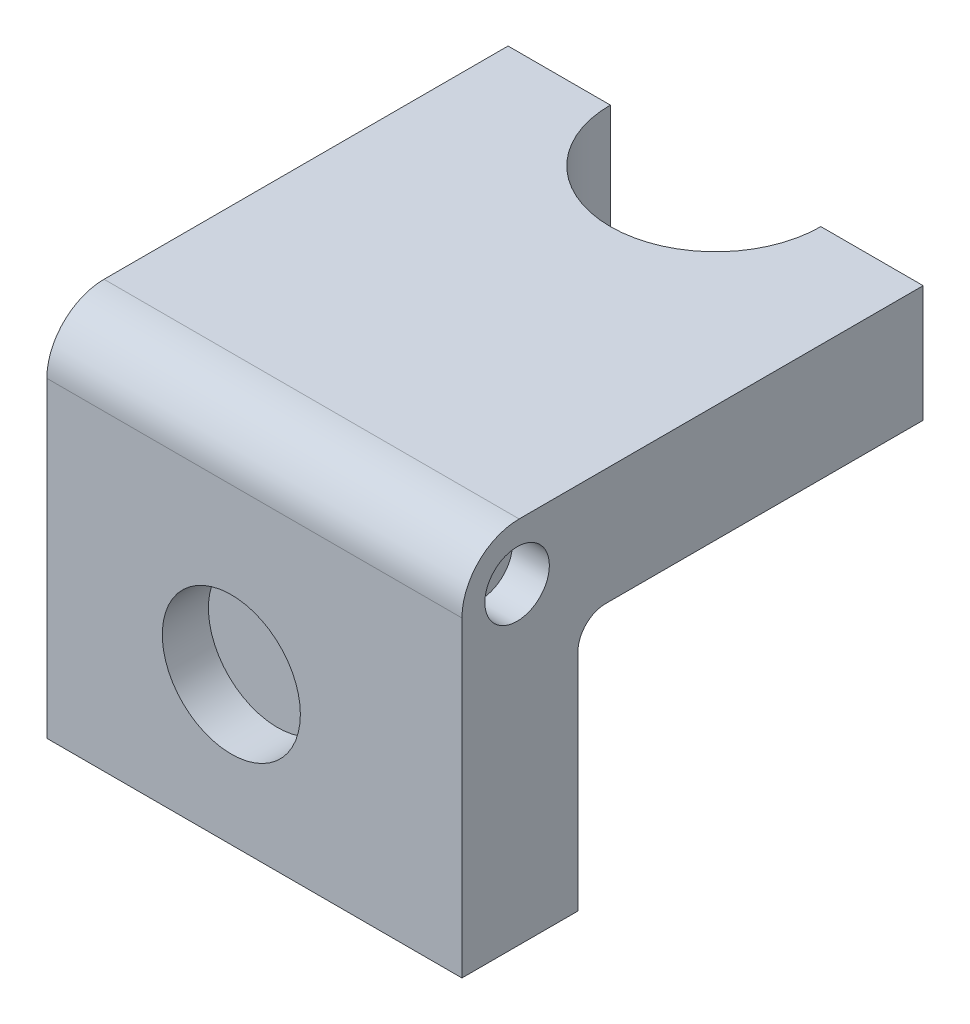
ISO-10303-21;
HEADER;
FILE_DESCRIPTION(('STEP AP214'),'2;1');
FILE_NAME('part.step','',(''),(''),'','','');
FILE_SCHEMA(('AUTOMOTIVE_DESIGN { 1 0 10303 214 1 1 1 1 }'));
ENDSEC;
DATA;
#1=APPLICATION_CONTEXT('core data for automotive mechanical design processes');
#2=APPLICATION_PROTOCOL_DEFINITION('international standard','automotive_design',2000,#1);
#3=PRODUCT_CONTEXT('',#1,'mechanical');
#4=PRODUCT('Part','Part','',(#3));
#5=PRODUCT_RELATED_PRODUCT_CATEGORY('part','',(#4));
#6=PRODUCT_DEFINITION_FORMATION('','',#4);
#7=PRODUCT_DEFINITION_CONTEXT('part definition',#1,'design');
#8=PRODUCT_DEFINITION('design','',#6,#7);
#9=PRODUCT_DEFINITION_SHAPE('','',#8);
#10=(LENGTH_UNIT() NAMED_UNIT(*) SI_UNIT(.MILLI.,.METRE.));
#11=(NAMED_UNIT(*) PLANE_ANGLE_UNIT() SI_UNIT($,.RADIAN.));
#12=(NAMED_UNIT(*) SI_UNIT($,.STERADIAN.) SOLID_ANGLE_UNIT());
#13=UNCERTAINTY_MEASURE_WITH_UNIT(LENGTH_MEASURE(1.E-05),#10,'distance_accuracy_value','');
#14=(GEOMETRIC_REPRESENTATION_CONTEXT(3) GLOBAL_UNCERTAINTY_ASSIGNED_CONTEXT((#13)) GLOBAL_UNIT_ASSIGNED_CONTEXT((#10,
#11,#12)) REPRESENTATION_CONTEXT('',''));
#15=CARTESIAN_POINT('',(0.,0.,0.));
#16=DIRECTION('',(0.,0.,1.));
#17=DIRECTION('',(1.,0.,0.));
#18=AXIS2_PLACEMENT_3D('',#15,#16,#17);
#19=CARTESIAN_POINT('',(0.,0.,0.));
#20=DIRECTION('',(0.,0.,-1.));
#21=DIRECTION('',(-1.,0.,0.));
#22=AXIS2_PLACEMENT_3D('',#19,#20,#21);
#23=PLANE('',#22);
#24=DIRECTION('',(-1.,0.,0.));
#25=VECTOR('',#24,1.);
#26=CARTESIAN_POINT('',(0.,50.8,0.));
#27=LINE('',#26,#25);
#28=CARTESIAN_POINT('',(14.0819477642499,50.8,0.));
#29=VERTEX_POINT('',#28);
#30=CARTESIAN_POINT('',(0.,50.8,0.));
#31=VERTEX_POINT('',#30);
#32=EDGE_CURVE('E152',#29,#31,#27,.T.);
#33=ORIENTED_EDGE('',*,*,#32,.F.);
#34=DIRECTION('',(0.,1.,0.));
#35=VECTOR('',#34,1.);
#36=CARTESIAN_POINT('',(14.0819477642499,25.4,0.));
#37=LINE('',#36,#35);
#38=CARTESIAN_POINT('',(14.0819477642499,34.7459144640634,0.));
#39=VERTEX_POINT('',#38);
#40=EDGE_CURVE('E130',#39,#29,#37,.T.);
#41=ORIENTED_EDGE('',*,*,#40,.F.);
#42=DIRECTION('',(1.,0.,0.));
#43=VECTOR('',#42,1.);
#44=CARTESIAN_POINT('',(0.,34.7459144640634,0.));
#45=LINE('',#44,#43);
#46=CARTESIAN_POINT('',(0.,34.7459144640634,0.));
#47=VERTEX_POINT('',#46);
#48=EDGE_CURVE('E236',#47,#39,#45,.T.);
#49=ORIENTED_EDGE('',*,*,#48,.F.);
#50=DIRECTION('',(0.,-1.,0.));
#51=VECTOR('',#50,1.);
#52=CARTESIAN_POINT('',(0.,0.,0.));
#53=LINE('',#52,#51);
#54=EDGE_CURVE('E244',#31,#47,#53,.T.);
#55=ORIENTED_EDGE('',*,*,#54,.F.);
#56=EDGE_LOOP('',(#33,#41,#49,#55));
#57=FACE_BOUND('',#56,.T.);
#58=ADVANCED_FACE('F51',(#57),#23,.T.);
#59=CARTESIAN_POINT('',(43.0680522357501,34.7459144640634,0.));
#60=VERTEX_POINT('',#59);
#61=CARTESIAN_POINT('',(57.15,34.7459144640634,0.));
#62=VERTEX_POINT('',#61);
#63=EDGE_CURVE('E142',#60,#62,#45,.T.);
#64=ORIENTED_EDGE('',*,*,#63,.F.);
#65=DIRECTION('',(0.,1.,0.));
#66=VECTOR('',#65,1.);
#67=CARTESIAN_POINT('',(43.0680522357501,25.4,0.));
#68=LINE('',#67,#66);
#69=CARTESIAN_POINT('',(43.0680522357501,50.8,0.));
#70=VERTEX_POINT('',#69);
#71=EDGE_CURVE('E66',#60,#70,#68,.T.);
#72=ORIENTED_EDGE('',*,*,#71,.T.);
#73=CARTESIAN_POINT('',(57.15,50.8,0.));
#74=VERTEX_POINT('',#73);
#75=EDGE_CURVE('E141',#74,#70,#27,.T.);
#76=ORIENTED_EDGE('',*,*,#75,.F.);
#77=DIRECTION('',(0.,1.,0.));
#78=VECTOR('',#77,1.);
#79=CARTESIAN_POINT('',(57.15,0.,0.));
#80=LINE('',#79,#78);
#81=EDGE_CURVE('E158',#62,#74,#80,.T.);
#82=ORIENTED_EDGE('',*,*,#81,.F.);
#83=EDGE_LOOP('',(#64,#72,#76,#82));
#84=FACE_BOUND('',#83,.T.);
#85=ADVANCED_FACE('F139',(#84),#23,.T.);
#86=CARTESIAN_POINT('',(0.,0.,63.5));
#87=DIRECTION('',(1.,0.,0.));
#88=DIRECTION('',(0.,0.,-1.));
#89=AXIS2_PLACEMENT_3D('',#86,#87,#88);
#90=PLANE('',#89);
#91=DIRECTION('',(0.,0.,1.));
#92=VECTOR('',#91,1.);
#93=CARTESIAN_POINT('',(0.,34.7459144640634,0.));
#94=LINE('',#93,#92);
#95=CARTESIAN_POINT('',(0.,34.7459144640634,43.7146070722916));
#96=VERTEX_POINT('',#95);
#97=EDGE_CURVE('E207',#47,#96,#94,.T.);
#98=ORIENTED_EDGE('',*,*,#97,.T.);
#99=CARTESIAN_POINT('',(0.,30.9359144640634,43.7146070722916));
#100=DIRECTION('',(1.,0.,0.));
#101=DIRECTION('',(0.,0.,-1.));
#102=AXIS2_PLACEMENT_3D('',#99,#100,#101);
#103=CIRCLE('',#102,3.81);
#104=CARTESIAN_POINT('',(0.,30.9359144640634,47.5246070722916));
#105=VERTEX_POINT('',#104);
#106=EDGE_CURVE('E60',#96,#105,#103,.T.);
#107=ORIENTED_EDGE('',*,*,#106,.T.);
#108=DIRECTION('',(0.,-1.,0.));
#109=VECTOR('',#108,1.);
#110=CARTESIAN_POINT('',(0.,0.,47.5246070722916));
#111=LINE('',#110,#109);
#112=CARTESIAN_POINT('',(0.,0.,47.5246070722916));
#113=VERTEX_POINT('',#112);
#114=EDGE_CURVE('E204',#105,#113,#111,.T.);
#115=ORIENTED_EDGE('',*,*,#114,.T.);
#116=DIRECTION('',(0.,0.,-1.));
#117=VECTOR('',#116,1.);
#118=CARTESIAN_POINT('',(0.,0.,63.5));
#119=LINE('',#118,#117);
#120=CARTESIAN_POINT('',(0.,0.,63.5));
#121=VERTEX_POINT('',#120);
#122=EDGE_CURVE('E173',#121,#113,#119,.T.);
#123=ORIENTED_EDGE('',*,*,#122,.F.);
#124=DIRECTION('',(0.,-1.,0.));
#125=VECTOR('',#124,1.);
#126=CARTESIAN_POINT('',(0.,0.,63.5));
#127=LINE('',#126,#125);
#128=CARTESIAN_POINT('',(0.,42.926,63.5));
#129=VERTEX_POINT('',#128);
#130=EDGE_CURVE('E151',#129,#121,#127,.T.);
#131=ORIENTED_EDGE('',*,*,#130,.F.);
#132=CARTESIAN_POINT('',(0.,42.926,55.626));
#133=DIRECTION('',(1.,0.,0.));
#134=DIRECTION('',(0.,0.,-1.));
#135=AXIS2_PLACEMENT_3D('',#132,#133,#134);
#136=CIRCLE('',#135,7.874);
#137=CARTESIAN_POINT('',(0.,50.8,55.626));
#138=VERTEX_POINT('',#137);
#139=EDGE_CURVE('E181',#129,#138,#136,.F.);
#140=ORIENTED_EDGE('',*,*,#139,.T.);
#141=DIRECTION('',(0.,0.,-1.));
#142=VECTOR('',#141,1.);
#143=CARTESIAN_POINT('',(0.,50.8,63.5));
#144=LINE('',#143,#142);
#145=EDGE_CURVE('E162',#138,#31,#144,.T.);
#146=ORIENTED_EDGE('',*,*,#145,.T.);
#147=ORIENTED_EDGE('',*,*,#54,.T.);
#148=EDGE_LOOP('',(#98,#107,#115,#123,#131,#140,#146,#147));
#149=FACE_BOUND('',#148,.T.);
#150=ADVANCED_FACE('F202',(#149),#90,.F.);
#151=CARTESIAN_POINT('',(0.,0.,63.5));
#152=DIRECTION('',(0.,1.,0.));
#153=DIRECTION('',(0.,0.,1.));
#154=AXIS2_PLACEMENT_3D('',#151,#152,#153);
#155=PLANE('',#154);
#156=ORIENTED_EDGE('',*,*,#122,.T.);
#157=DIRECTION('',(1.,0.,0.));
#158=VECTOR('',#157,1.);
#159=CARTESIAN_POINT('',(0.,0.,47.5246070722916));
#160=LINE('',#159,#158);
#161=CARTESIAN_POINT('',(57.15,0.,47.5246070722916));
#162=VERTEX_POINT('',#161);
#163=EDGE_CURVE('E214',#113,#162,#160,.T.);
#164=ORIENTED_EDGE('',*,*,#163,.T.);
#165=DIRECTION('',(0.,0.,-1.));
#166=VECTOR('',#165,1.);
#167=CARTESIAN_POINT('',(57.15,0.,63.5));
#168=LINE('',#167,#166);
#169=CARTESIAN_POINT('',(57.15,0.,63.5));
#170=VERTEX_POINT('',#169);
#171=EDGE_CURVE('E169',#170,#162,#168,.T.);
#172=ORIENTED_EDGE('',*,*,#171,.F.);
#173=DIRECTION('',(1.,0.,0.));
#174=VECTOR('',#173,1.);
#175=CARTESIAN_POINT('',(0.,0.,63.5));
#176=LINE('',#175,#174);
#177=EDGE_CURVE('E156',#121,#170,#176,.T.);
#178=ORIENTED_EDGE('',*,*,#177,.F.);
#179=EDGE_LOOP('',(#156,#164,#172,#178));
#180=FACE_BOUND('',#179,.T.);
#181=ADVANCED_FACE('F267',(#180),#155,.F.);
#182=CARTESIAN_POINT('',(57.15,0.,63.5));
#183=DIRECTION('',(-1.,0.,0.));
#184=DIRECTION('',(0.,0.,1.));
#185=AXIS2_PLACEMENT_3D('',#182,#183,#184);
#186=PLANE('',#185);
#187=CARTESIAN_POINT('',(57.15,43.18,55.9066070722916));
#188=DIRECTION('',(1.,0.,0.));
#189=DIRECTION('',(0.,0.,-1.));
#190=AXIS2_PLACEMENT_3D('',#187,#188,#189);
#191=CIRCLE('',#190,4.44219446011166);
#192=CARTESIAN_POINT('',(57.15,43.18,51.46441261218));
#193=VERTEX_POINT('',#192);
#194=EDGE_CURVE('E144',#193,#193,#191,.T.);
#195=ORIENTED_EDGE('',*,*,#194,.F.);
#196=EDGE_LOOP('',(#195));
#197=FACE_BOUND('',#196,.T.);
#198=ORIENTED_EDGE('',*,*,#171,.T.);
#199=DIRECTION('',(0.,-1.,0.));
#200=VECTOR('',#199,1.);
#201=CARTESIAN_POINT('',(57.15,0.,47.5246070722916));
#202=LINE('',#201,#200);
#203=CARTESIAN_POINT('',(57.15,30.9359144640634,47.5246070722916));
#204=VERTEX_POINT('',#203);
#205=EDGE_CURVE('E221',#204,#162,#202,.T.);
#206=ORIENTED_EDGE('',*,*,#205,.F.);
#207=CARTESIAN_POINT('',(57.15,30.9359144640634,43.7146070722916));
#208=DIRECTION('',(-1.,0.,0.));
#209=DIRECTION('',(0.,0.,1.));
#210=AXIS2_PLACEMENT_3D('',#207,#208,#209);
#211=CIRCLE('',#210,3.81);
#212=CARTESIAN_POINT('',(57.15,34.7459144640634,43.7146070722916));
#213=VERTEX_POINT('',#212);
#214=EDGE_CURVE('E196',#204,#213,#211,.T.);
#215=ORIENTED_EDGE('',*,*,#214,.T.);
#216=DIRECTION('',(0.,0.,1.));
#217=VECTOR('',#216,1.);
#218=CARTESIAN_POINT('',(57.15,34.7459144640634,0.));
#219=LINE('',#218,#217);
#220=EDGE_CURVE('E220',#62,#213,#219,.T.);
#221=ORIENTED_EDGE('',*,*,#220,.F.);
#222=ORIENTED_EDGE('',*,*,#81,.T.);
#223=DIRECTION('',(0.,0.,-1.));
#224=VECTOR('',#223,1.);
#225=CARTESIAN_POINT('',(57.15,50.8,63.5));
#226=LINE('',#225,#224);
#227=CARTESIAN_POINT('',(57.15,50.8,55.626));
#228=VERTEX_POINT('',#227);
#229=EDGE_CURVE('E149',#228,#74,#226,.T.);
#230=ORIENTED_EDGE('',*,*,#229,.F.);
#231=CARTESIAN_POINT('',(57.15,42.926,55.626));
#232=DIRECTION('',(-1.,0.,0.));
#233=DIRECTION('',(0.,0.,1.));
#234=AXIS2_PLACEMENT_3D('',#231,#232,#233);
#235=CIRCLE('',#234,7.874);
#236=CARTESIAN_POINT('',(57.15,42.926,63.5));
#237=VERTEX_POINT('',#236);
#238=EDGE_CURVE('E187',#228,#237,#235,.F.);
#239=ORIENTED_EDGE('',*,*,#238,.T.);
#240=DIRECTION('',(0.,1.,0.));
#241=VECTOR('',#240,1.);
#242=CARTESIAN_POINT('',(57.15,0.,63.5));
#243=LINE('',#242,#241);
#244=EDGE_CURVE('E166',#170,#237,#243,.T.);
#245=ORIENTED_EDGE('',*,*,#244,.F.);
#246=EDGE_LOOP('',(#198,#206,#215,#221,#222,#230,#239,#245));
#247=FACE_BOUND('',#246,.T.);
#248=ADVANCED_FACE('F219',(#197,#247),#186,.F.);
#249=CARTESIAN_POINT('',(0.,50.8,63.5));
#250=DIRECTION('',(0.,-1.,0.));
#251=DIRECTION('',(0.,0.,-1.));
#252=AXIS2_PLACEMENT_3D('',#249,#250,#251);
#253=PLANE('',#252);
#254=CARTESIAN_POINT('',(28.575,50.8,0.));
#255=DIRECTION('',(0.,-1.,0.));
#256=DIRECTION('',(0.,0.,-1.));
#257=AXIS2_PLACEMENT_3D('',#254,#255,#256);
#258=CIRCLE('',#257,14.4930522357501);
#259=EDGE_CURVE('E127',#70,#29,#258,.T.);
#260=ORIENTED_EDGE('',*,*,#259,.T.);
#261=ORIENTED_EDGE('',*,*,#32,.T.);
#262=ORIENTED_EDGE('',*,*,#145,.F.);
#263=DIRECTION('',(-1.,0.,0.));
#264=VECTOR('',#263,1.);
#265=CARTESIAN_POINT('',(0.,50.8,55.626));
#266=LINE('',#265,#264);
#267=EDGE_CURVE('E184',#138,#228,#266,.F.);
#268=ORIENTED_EDGE('',*,*,#267,.T.);
#269=ORIENTED_EDGE('',*,*,#229,.T.);
#270=ORIENTED_EDGE('',*,*,#75,.T.);
#271=EDGE_LOOP('',(#260,#261,#262,#268,#269,#270));
#272=FACE_BOUND('',#271,.T.);
#273=ADVANCED_FACE('F147',(#272),#253,.F.);
#274=CARTESIAN_POINT('',(0.,0.,63.5));
#275=DIRECTION('',(0.,0.,-1.));
#276=DIRECTION('',(-1.,0.,0.));
#277=AXIS2_PLACEMENT_3D('',#274,#275,#276);
#278=PLANE('',#277);
#279=CARTESIAN_POINT('',(25.4,20.32,63.5));
#280=DIRECTION('',(0.,0.,1.));
#281=DIRECTION('',(1.,0.,0.));
#282=AXIS2_PLACEMENT_3D('',#279,#280,#281);
#283=CIRCLE('',#282,9.50614048607859);
#284=CARTESIAN_POINT('',(34.9061404860786,20.32,63.5));
#285=VERTEX_POINT('',#284);
#286=EDGE_CURVE('E235',#285,#285,#283,.T.);
#287=ORIENTED_EDGE('',*,*,#286,.F.);
#288=EDGE_LOOP('',(#287));
#289=FACE_BOUND('',#288,.T.);
#290=ORIENTED_EDGE('',*,*,#244,.T.);
#291=DIRECTION('',(-1.,0.,0.));
#292=VECTOR('',#291,1.);
#293=CARTESIAN_POINT('',(0.,42.926,63.5));
#294=LINE('',#293,#292);
#295=EDGE_CURVE('E177',#237,#129,#294,.T.);
#296=ORIENTED_EDGE('',*,*,#295,.T.);
#297=ORIENTED_EDGE('',*,*,#130,.T.);
#298=ORIENTED_EDGE('',*,*,#177,.T.);
#299=EDGE_LOOP('',(#290,#296,#297,#298));
#300=FACE_BOUND('',#299,.T.);
#301=ADVANCED_FACE('F263',(#289,#300),#278,.F.);
#302=CARTESIAN_POINT('',(25.4,20.32,57.15));
#303=DIRECTION('',(0.,0.,1.));
#304=DIRECTION('',(1.,0.,0.));
#305=AXIS2_PLACEMENT_3D('',#302,#303,#304);
#306=CYLINDRICAL_SURFACE('',#305,9.50614048607859);
#307=CARTESIAN_POINT('',(25.4,20.32,57.15));
#308=DIRECTION('',(0.,0.,1.));
#309=DIRECTION('',(1.,0.,0.));
#310=AXIS2_PLACEMENT_3D('',#307,#308,#309);
#311=CIRCLE('',#310,9.50614048607859);
#312=CARTESIAN_POINT('',(34.9061404860786,20.32,57.15));
#313=VERTEX_POINT('',#312);
#314=EDGE_CURVE('E240',#313,#313,#311,.T.);
#315=ORIENTED_EDGE('',*,*,#314,.F.);
#316=EDGE_LOOP('',(#315));
#317=FACE_BOUND('',#316,.T.);
#318=ORIENTED_EDGE('',*,*,#286,.T.);
#319=EDGE_LOOP('',(#318));
#320=FACE_BOUND('',#319,.T.);
#321=ADVANCED_FACE('F291',(#317,#320),#306,.F.);
#322=CARTESIAN_POINT('',(25.4,20.32,57.15));
#323=DIRECTION('',(0.,0.,1.));
#324=DIRECTION('',(1.,0.,0.));
#325=AXIS2_PLACEMENT_3D('',#322,#323,#324);
#326=PLANE('',#325);
#327=ORIENTED_EDGE('',*,*,#314,.T.);
#328=EDGE_LOOP('',(#327));
#329=FACE_BOUND('',#328,.T.);
#330=ADVANCED_FACE('F296',(#329),#326,.T.);
#331=CARTESIAN_POINT('',(0.,42.926,55.626));
#332=DIRECTION('',(-1.,0.,0.));
#333=DIRECTION('',(0.,0.,1.));
#334=AXIS2_PLACEMENT_3D('',#331,#332,#333);
#335=CYLINDRICAL_SURFACE('',#334,7.874);
#336=ORIENTED_EDGE('',*,*,#238,.F.);
#337=ORIENTED_EDGE('',*,*,#267,.F.);
#338=ORIENTED_EDGE('',*,*,#139,.F.);
#339=ORIENTED_EDGE('',*,*,#295,.F.);
#340=EDGE_LOOP('',(#336,#337,#338,#339));
#341=FACE_BOUND('',#340,.T.);
#342=ADVANCED_FACE('F260',(#341),#335,.T.);
#343=CARTESIAN_POINT('',(0.,0.,47.5246070722916));
#344=DIRECTION('',(0.,0.,1.));
#345=DIRECTION('',(1.,0.,0.));
#346=AXIS2_PLACEMENT_3D('',#343,#344,#345);
#347=PLANE('',#346);
#348=ORIENTED_EDGE('',*,*,#114,.F.);
#349=DIRECTION('',(1.,0.,0.));
#350=VECTOR('',#349,1.);
#351=CARTESIAN_POINT('',(57.15,30.9359144640634,47.5246070722916));
#352=LINE('',#351,#350);
#353=EDGE_CURVE('E190',#105,#204,#352,.T.);
#354=ORIENTED_EDGE('',*,*,#353,.T.);
#355=ORIENTED_EDGE('',*,*,#205,.T.);
#356=ORIENTED_EDGE('',*,*,#163,.F.);
#357=EDGE_LOOP('',(#348,#354,#355,#356));
#358=FACE_BOUND('',#357,.T.);
#359=ADVANCED_FACE('F211',(#358),#347,.F.);
#360=CARTESIAN_POINT('',(0.,34.7459144640634,0.));
#361=DIRECTION('',(0.,1.,0.));
#362=DIRECTION('',(0.,0.,1.));
#363=AXIS2_PLACEMENT_3D('',#360,#361,#362);
#364=PLANE('',#363);
#365=CARTESIAN_POINT('',(28.575,34.7459144640634,0.));
#366=DIRECTION('',(0.,1.,0.));
#367=DIRECTION('',(0.,0.,1.));
#368=AXIS2_PLACEMENT_3D('',#365,#366,#367);
#369=CIRCLE('',#368,14.4930522357501);
#370=EDGE_CURVE('E13',#60,#39,#369,.F.);
#371=ORIENTED_EDGE('',*,*,#370,.F.);
#372=ORIENTED_EDGE('',*,*,#63,.T.);
#373=ORIENTED_EDGE('',*,*,#220,.T.);
#374=DIRECTION('',(1.,0.,0.));
#375=VECTOR('',#374,1.);
#376=CARTESIAN_POINT('',(0.,34.7459144640634,43.7146070722916));
#377=LINE('',#376,#375);
#378=EDGE_CURVE('E74',#213,#96,#377,.F.);
#379=ORIENTED_EDGE('',*,*,#378,.T.);
#380=ORIENTED_EDGE('',*,*,#97,.F.);
#381=ORIENTED_EDGE('',*,*,#48,.T.);
#382=EDGE_LOOP('',(#371,#372,#373,#379,#380,#381));
#383=FACE_BOUND('',#382,.T.);
#384=ADVANCED_FACE('F222',(#383),#364,.F.);
#385=CARTESIAN_POINT('',(0.,30.9359144640634,43.7146070722916));
#386=DIRECTION('',(-1.,0.,0.));
#387=DIRECTION('',(0.,0.,1.));
#388=AXIS2_PLACEMENT_3D('',#385,#386,#387);
#389=CYLINDRICAL_SURFACE('',#388,3.81);
#390=ORIENTED_EDGE('',*,*,#106,.F.);
#391=ORIENTED_EDGE('',*,*,#378,.F.);
#392=ORIENTED_EDGE('',*,*,#214,.F.);
#393=ORIENTED_EDGE('',*,*,#353,.F.);
#394=EDGE_LOOP('',(#390,#391,#392,#393));
#395=FACE_BOUND('',#394,.T.);
#396=ADVANCED_FACE('F53',(#395),#389,.F.);
#397=CARTESIAN_POINT('',(52.07,43.18,55.9066070722916));
#398=DIRECTION('',(1.,0.,0.));
#399=DIRECTION('',(0.,0.,-1.));
#400=AXIS2_PLACEMENT_3D('',#397,#398,#399);
#401=CYLINDRICAL_SURFACE('',#400,4.44219446011166);
#402=CARTESIAN_POINT('',(52.07,43.18,55.9066070722916));
#403=DIRECTION('',(1.,0.,0.));
#404=DIRECTION('',(0.,0.,-1.));
#405=AXIS2_PLACEMENT_3D('',#402,#403,#404);
#406=CIRCLE('',#405,4.44219446011166);
#407=CARTESIAN_POINT('',(52.07,43.18,51.46441261218));
#408=VERTEX_POINT('',#407);
#409=EDGE_CURVE('E224',#408,#408,#406,.T.);
#410=ORIENTED_EDGE('',*,*,#409,.F.);
#411=EDGE_LOOP('',(#410));
#412=FACE_BOUND('',#411,.T.);
#413=ORIENTED_EDGE('',*,*,#194,.T.);
#414=EDGE_LOOP('',(#413));
#415=FACE_BOUND('',#414,.T.);
#416=ADVANCED_FACE('F311',(#412,#415),#401,.F.);
#417=CARTESIAN_POINT('',(52.07,43.18,55.9066070722916));
#418=DIRECTION('',(1.,0.,0.));
#419=DIRECTION('',(0.,0.,-1.));
#420=AXIS2_PLACEMENT_3D('',#417,#418,#419);
#421=PLANE('',#420);
#422=ORIENTED_EDGE('',*,*,#409,.T.);
#423=EDGE_LOOP('',(#422));
#424=FACE_BOUND('',#423,.T.);
#425=ADVANCED_FACE('F314',(#424),#421,.T.);
#426=CARTESIAN_POINT('',(28.575,25.4,0.));
#427=DIRECTION('',(0.,1.,0.));
#428=DIRECTION('',(0.,0.,1.));
#429=AXIS2_PLACEMENT_3D('',#426,#427,#428);
#430=CYLINDRICAL_SURFACE('',#429,14.4930522357501);
#431=ORIENTED_EDGE('',*,*,#370,.T.);
#432=ORIENTED_EDGE('',*,*,#40,.T.);
#433=ORIENTED_EDGE('',*,*,#259,.F.);
#434=ORIENTED_EDGE('',*,*,#71,.F.);
#435=EDGE_LOOP('',(#431,#432,#433,#434));
#436=FACE_BOUND('',#435,.T.);
#437=ADVANCED_FACE('F128',(#436),#430,.F.);
#438=CLOSED_SHELL('',(#58,#85,#150,#181,#248,#273,#301,#321,#330,#342,#359,#384,#396,#416,#425,#437));
#439=MANIFOLD_SOLID_BREP('B2',#438);
#440=ADVANCED_BREP_SHAPE_REPRESENTATION('',(#18,#439),#14);
#441=SHAPE_DEFINITION_REPRESENTATION(#9,#440);
ENDSEC;
END-ISO-10303-21;
